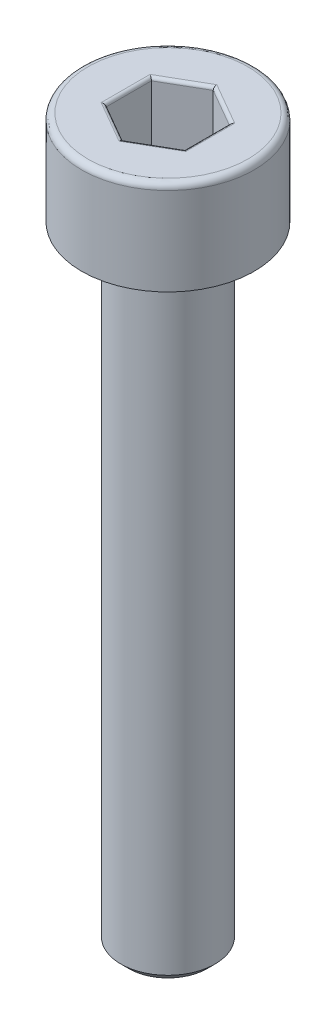
ISO-10303-21;
HEADER;
FILE_DESCRIPTION(('STEP AP214'),'2;1');
FILE_NAME('part.step','',(''),(''),'','','');
FILE_SCHEMA(('AUTOMOTIVE_DESIGN { 1 0 10303 214 1 1 1 1 }'));
ENDSEC;
DATA;
#1=APPLICATION_CONTEXT('core data for automotive mechanical design processes');
#2=APPLICATION_PROTOCOL_DEFINITION('international standard','automotive_design',2000,#1);
#3=PRODUCT_CONTEXT('',#1,'mechanical');
#4=PRODUCT('Part','Part','',(#3));
#5=PRODUCT_RELATED_PRODUCT_CATEGORY('part','',(#4));
#6=PRODUCT_DEFINITION_FORMATION('','',#4);
#7=PRODUCT_DEFINITION_CONTEXT('part definition',#1,'design');
#8=PRODUCT_DEFINITION('design','',#6,#7);
#9=PRODUCT_DEFINITION_SHAPE('','',#8);
#10=(LENGTH_UNIT() NAMED_UNIT(*) SI_UNIT(.MILLI.,.METRE.));
#11=(NAMED_UNIT(*) PLANE_ANGLE_UNIT() SI_UNIT($,.RADIAN.));
#12=(NAMED_UNIT(*) SI_UNIT($,.STERADIAN.) SOLID_ANGLE_UNIT());
#13=UNCERTAINTY_MEASURE_WITH_UNIT(LENGTH_MEASURE(1.E-05),#10,'distance_accuracy_value','');
#14=(GEOMETRIC_REPRESENTATION_CONTEXT(3) GLOBAL_UNCERTAINTY_ASSIGNED_CONTEXT((#13)) GLOBAL_UNIT_ASSIGNED_CONTEXT((#10,
#11,#12)) REPRESENTATION_CONTEXT('',''));
#15=CARTESIAN_POINT('',(0.,0.,0.));
#16=DIRECTION('',(0.,0.,1.));
#17=DIRECTION('',(1.,0.,0.));
#18=AXIS2_PLACEMENT_3D('',#15,#16,#17);
#19=CARTESIAN_POINT('',(0.,-23.,0.));
#20=DIRECTION('',(0.,-1.,0.));
#21=DIRECTION('',(0.,0.,-1.));
#22=AXIS2_PLACEMENT_3D('',#19,#20,#21);
#23=PLANE('',#22);
#24=CARTESIAN_POINT('',(0.,-23.,0.));
#25=DIRECTION('',(0.,-1.,0.));
#26=DIRECTION('',(0.,0.,-1.));
#27=AXIS2_PLACEMENT_3D('',#24,#25,#26);
#28=CIRCLE('',#27,1.25);
#29=CARTESIAN_POINT('',(0.,-23.,-1.25));
#30=VERTEX_POINT('',#29);
#31=EDGE_CURVE('E263',#30,#30,#28,.T.);
#32=ORIENTED_EDGE('',*,*,#31,.T.);
#33=EDGE_LOOP('',(#32));
#34=FACE_BOUND('',#33,.T.);
#35=ADVANCED_FACE('F35',(#34),#23,.T.);
#36=CARTESIAN_POINT('',(0.,0.,0.));
#37=DIRECTION('',(0.,1.,0.));
#38=DIRECTION('',(0.,0.,1.));
#39=AXIS2_PLACEMENT_3D('',#36,#37,#38);
#40=CYLINDRICAL_SURFACE('',#39,1.5);
#41=CARTESIAN_POINT('',(0.,-3.25,0.));
#42=DIRECTION('',(0.,-1.,0.));
#43=DIRECTION('',(0.,0.,-1.));
#44=AXIS2_PLACEMENT_3D('',#41,#42,#43);
#45=CIRCLE('',#44,1.5);
#46=CARTESIAN_POINT('',(0.,-3.25,-1.5));
#47=VERTEX_POINT('',#46);
#48=EDGE_CURVE('E260',#47,#47,#45,.T.);
#49=ORIENTED_EDGE('',*,*,#48,.T.);
#50=EDGE_LOOP('',(#49));
#51=FACE_BOUND('',#50,.T.);
#52=CARTESIAN_POINT('',(0.,-22.75,0.));
#53=DIRECTION('',(0.,-1.,0.));
#54=DIRECTION('',(0.,0.,-1.));
#55=AXIS2_PLACEMENT_3D('',#52,#53,#54);
#56=CIRCLE('',#55,1.5);
#57=CARTESIAN_POINT('',(0.,-22.75,-1.5));
#58=VERTEX_POINT('',#57);
#59=EDGE_CURVE('E257',#58,#58,#56,.F.);
#60=ORIENTED_EDGE('',*,*,#59,.T.);
#61=EDGE_LOOP('',(#60));
#62=FACE_BOUND('',#61,.T.);
#63=ADVANCED_FACE('F289',(#51,#62),#40,.T.);
#64=CARTESIAN_POINT('',(-1.5,-3.,0.));
#65=DIRECTION('',(0.,-1.,0.));
#66=DIRECTION('',(0.,0.,-1.));
#67=AXIS2_PLACEMENT_3D('',#64,#65,#66);
#68=PLANE('',#67);
#69=CARTESIAN_POINT('',(0.,-3.,0.));
#70=DIRECTION('',(0.,-1.,0.));
#71=DIRECTION('',(0.,0.,-1.));
#72=AXIS2_PLACEMENT_3D('',#69,#70,#71);
#73=CIRCLE('',#72,1.75);
#74=CARTESIAN_POINT('',(0.,-3.,-1.75));
#75=VERTEX_POINT('',#74);
#76=EDGE_CURVE('E254',#75,#75,#73,.F.);
#77=ORIENTED_EDGE('',*,*,#76,.T.);
#78=EDGE_LOOP('',(#77));
#79=FACE_BOUND('',#78,.T.);
#80=CARTESIAN_POINT('',(0.,-3.,0.));
#81=DIRECTION('',(0.,1.,0.));
#82=DIRECTION('',(0.,0.,1.));
#83=AXIS2_PLACEMENT_3D('',#80,#81,#82);
#84=CIRCLE('',#83,2.75);
#85=CARTESIAN_POINT('',(0.,-3.,2.75));
#86=VERTEX_POINT('',#85);
#87=EDGE_CURVE('E251',#86,#86,#84,.T.);
#88=ORIENTED_EDGE('',*,*,#87,.F.);
#89=EDGE_LOOP('',(#88));
#90=FACE_BOUND('',#89,.T.);
#91=ADVANCED_FACE('F295',(#79,#90),#68,.T.);
#92=CARTESIAN_POINT('',(0.,0.,0.));
#93=DIRECTION('',(0.,1.,0.));
#94=DIRECTION('',(0.,0.,1.));
#95=AXIS2_PLACEMENT_3D('',#92,#93,#94);
#96=CYLINDRICAL_SURFACE('',#95,2.75);
#97=CARTESIAN_POINT('',(0.,-0.2,0.));
#98=DIRECTION('',(0.,1.,0.));
#99=DIRECTION('',(0.,0.,1.));
#100=AXIS2_PLACEMENT_3D('',#97,#98,#99);
#101=CIRCLE('',#100,2.75);
#102=CARTESIAN_POINT('',(0.,-0.2,2.75));
#103=VERTEX_POINT('',#102);
#104=EDGE_CURVE('E161',#103,#103,#101,.F.);
#105=ORIENTED_EDGE('',*,*,#104,.T.);
#106=EDGE_LOOP('',(#105));
#107=FACE_BOUND('',#106,.T.);
#108=ORIENTED_EDGE('',*,*,#87,.T.);
#109=EDGE_LOOP('',(#108));
#110=FACE_BOUND('',#109,.T.);
#111=ADVANCED_FACE('F305',(#107,#110),#96,.T.);
#112=CARTESIAN_POINT('',(-2.75,0.,0.));
#113=DIRECTION('',(0.,1.,0.));
#114=DIRECTION('',(0.,0.,1.));
#115=AXIS2_PLACEMENT_3D('',#112,#113,#114);
#116=PLANE('',#115);
#117=DIRECTION('',(0.,0.,1.));
#118=VECTOR('',#117,1.);
#119=CARTESIAN_POINT('',(-1.35,0.,-0.721687836487033));
#120=LINE('',#119,#118);
#121=CARTESIAN_POINT('',(-1.35,0.,0.779422863405995));
#122=VERTEX_POINT('',#121);
#123=CARTESIAN_POINT('',(-1.35,0.,-0.779422863405995));
#124=VERTEX_POINT('',#123);
#125=EDGE_CURVE('E177',#122,#124,#120,.F.);
#126=ORIENTED_EDGE('',*,*,#125,.T.);
#127=DIRECTION('',(-0.866025403784439,0.,0.5));
#128=VECTOR('',#127,1.);
#129=CARTESIAN_POINT('',(-0.0500000000000002,0.,-1.52997821335251));
#130=LINE('',#129,#128);
#131=CARTESIAN_POINT('',(0.,0.,-1.55884572681199));
#132=VERTEX_POINT('',#131);
#133=EDGE_CURVE('E136',#124,#132,#130,.F.);
#134=ORIENTED_EDGE('',*,*,#133,.T.);
#135=DIRECTION('',(-0.866025403784439,0.,-0.5));
#136=VECTOR('',#135,1.);
#137=CARTESIAN_POINT('',(1.3,0.,-0.808290376865477));
#138=LINE('',#137,#136);
#139=CARTESIAN_POINT('',(1.35,0.,-0.779422863405995));
#140=VERTEX_POINT('',#139);
#141=EDGE_CURVE('E163',#132,#140,#138,.F.);
#142=ORIENTED_EDGE('',*,*,#141,.T.);
#143=DIRECTION('',(0.,0.,-1.));
#144=VECTOR('',#143,1.);
#145=CARTESIAN_POINT('',(1.35,0.,0.721687836487034));
#146=LINE('',#145,#144);
#147=CARTESIAN_POINT('',(1.35,0.,0.779422863405996));
#148=VERTEX_POINT('',#147);
#149=EDGE_CURVE('E171',#140,#148,#146,.F.);
#150=ORIENTED_EDGE('',*,*,#149,.T.);
#151=DIRECTION('',(0.866025403784439,0.,-0.5));
#152=VECTOR('',#151,1.);
#153=CARTESIAN_POINT('',(0.05,0.,1.52997821335251));
#154=LINE('',#153,#152);
#155=CARTESIAN_POINT('',(0.,0.,1.55884572681199));
#156=VERTEX_POINT('',#155);
#157=EDGE_CURVE('E173',#148,#156,#154,.F.);
#158=ORIENTED_EDGE('',*,*,#157,.T.);
#159=DIRECTION('',(0.866025403784438,0.,0.5));
#160=VECTOR('',#159,1.);
#161=CARTESIAN_POINT('',(-1.3,0.,0.808290376865476));
#162=LINE('',#161,#160);
#163=EDGE_CURVE('E175',#156,#122,#162,.F.);
#164=ORIENTED_EDGE('',*,*,#163,.T.);
#165=EDGE_LOOP('',(#126,#134,#142,#150,#158,#164));
#166=FACE_BOUND('',#165,.T.);
#167=CARTESIAN_POINT('',(0.,0.,0.));
#168=DIRECTION('',(0.,1.,0.));
#169=DIRECTION('',(0.,0.,1.));
#170=AXIS2_PLACEMENT_3D('',#167,#168,#169);
#171=CIRCLE('',#170,2.55);
#172=CARTESIAN_POINT('',(0.,0.,2.55));
#173=VERTEX_POINT('',#172);
#174=EDGE_CURVE('E166',#173,#173,#171,.T.);
#175=ORIENTED_EDGE('',*,*,#174,.T.);
#176=EDGE_LOOP('',(#175));
#177=FACE_BOUND('',#176,.T.);
#178=ADVANCED_FACE('F268',(#166,#177),#116,.T.);
#179=CARTESIAN_POINT('',(0.,-3.,0.));
#180=DIRECTION('',(0.,1.,0.));
#181=DIRECTION('',(0.,0.,1.));
#182=AXIS2_PLACEMENT_3D('',#179,#180,#181);
#183=CONICAL_SURFACE('',#182,1.75,0.785398163397452);
#184=ORIENTED_EDGE('',*,*,#48,.F.);
#185=EDGE_LOOP('',(#184));
#186=FACE_BOUND('',#185,.T.);
#187=ORIENTED_EDGE('',*,*,#76,.F.);
#188=EDGE_LOOP('',(#187));
#189=FACE_BOUND('',#188,.T.);
#190=ADVANCED_FACE('F283',(#186,#189),#183,.T.);
#191=CARTESIAN_POINT('',(0.,-22.75,0.));
#192=DIRECTION('',(0.,1.,0.));
#193=DIRECTION('',(0.,0.,1.));
#194=AXIS2_PLACEMENT_3D('',#191,#192,#193);
#195=CONICAL_SURFACE('',#194,1.5,0.785398163397444);
#196=ORIENTED_EDGE('',*,*,#31,.F.);
#197=EDGE_LOOP('',(#196));
#198=FACE_BOUND('',#197,.T.);
#199=ORIENTED_EDGE('',*,*,#59,.F.);
#200=EDGE_LOOP('',(#199));
#201=FACE_BOUND('',#200,.T.);
#202=ADVANCED_FACE('F273',(#198,#201),#195,.T.);
#203=CARTESIAN_POINT('',(0.,-0.2,0.));
#204=DIRECTION('',(0.,1.,0.));
#205=DIRECTION('',(0.,0.,1.));
#206=AXIS2_PLACEMENT_3D('',#203,#204,#205);
#207=TOROIDAL_SURFACE('',#206,2.55,0.2);
#208=ORIENTED_EDGE('',*,*,#104,.F.);
#209=EDGE_LOOP('',(#208));
#210=FACE_BOUND('',#209,.T.);
#211=ORIENTED_EDGE('',*,*,#174,.F.);
#212=EDGE_LOOP('',(#211));
#213=FACE_BOUND('',#212,.T.);
#214=ADVANCED_FACE('F270',(#210,#213),#207,.T.);
#215=CARTESIAN_POINT('',(1.25,-2.,-0.721687836487033));
#216=DIRECTION('',(0.5,0.,-0.866025403784439));
#217=DIRECTION('',(-0.866025403784439,0.,-0.5));
#218=AXIS2_PLACEMENT_3D('',#215,#216,#217);
#219=PLANE('',#218);
#220=DIRECTION('',(0.,1.,0.));
#221=VECTOR('',#220,1.);
#222=CARTESIAN_POINT('',(1.25,-2.,-0.721687836487033));
#223=LINE('',#222,#221);
#224=CARTESIAN_POINT('',(1.25,-1.9,-0.721687836487033));
#225=VERTEX_POINT('',#224);
#226=CARTESIAN_POINT('',(1.25,-0.1,-0.721687836487033));
#227=VERTEX_POINT('',#226);
#228=EDGE_CURVE('E245',#225,#227,#223,.T.);
#229=ORIENTED_EDGE('',*,*,#228,.T.);
#230=DIRECTION('',(-0.866025403784439,0.,-0.5));
#231=VECTOR('',#230,1.);
#232=CARTESIAN_POINT('',(0.,-0.1,-1.44337567297406));
#233=LINE('',#232,#231);
#234=CARTESIAN_POINT('',(0.,-0.1,-1.44337567297406));
#235=VERTEX_POINT('',#234);
#236=EDGE_CURVE('E197',#227,#235,#233,.T.);
#237=ORIENTED_EDGE('',*,*,#236,.T.);
#238=DIRECTION('',(0.,1.,0.));
#239=VECTOR('',#238,1.);
#240=CARTESIAN_POINT('',(0.,-2.,-1.44337567297406));
#241=LINE('',#240,#239);
#242=CARTESIAN_POINT('',(0.,-1.9,-1.44337567297406));
#243=VERTEX_POINT('',#242);
#244=EDGE_CURVE('E147',#243,#235,#241,.T.);
#245=ORIENTED_EDGE('',*,*,#244,.F.);
#246=DIRECTION('',(-0.866025403784439,0.,-0.5));
#247=VECTOR('',#246,1.);
#248=CARTESIAN_POINT('',(1.25,-1.9,-0.721687836487033));
#249=LINE('',#248,#247);
#250=EDGE_CURVE('E195',#243,#225,#249,.F.);
#251=ORIENTED_EDGE('',*,*,#250,.T.);
#252=EDGE_LOOP('',(#229,#237,#245,#251));
#253=FACE_BOUND('',#252,.T.);
#254=ADVANCED_FACE('F272',(#253),#219,.F.);
#255=CARTESIAN_POINT('',(1.25,-2.,0.721687836487034));
#256=DIRECTION('',(1.,0.,0.));
#257=DIRECTION('',(0.,0.,-1.));
#258=AXIS2_PLACEMENT_3D('',#255,#256,#257);
#259=PLANE('',#258);
#260=DIRECTION('',(0.,1.,0.));
#261=VECTOR('',#260,1.);
#262=CARTESIAN_POINT('',(1.25,-2.,0.721687836487034));
#263=LINE('',#262,#261);
#264=CARTESIAN_POINT('',(1.25,-1.9,0.721687836487034));
#265=VERTEX_POINT('',#264);
#266=CARTESIAN_POINT('',(1.25,-0.1,0.721687836487034));
#267=VERTEX_POINT('',#266);
#268=EDGE_CURVE('E242',#265,#267,#263,.T.);
#269=ORIENTED_EDGE('',*,*,#268,.T.);
#270=DIRECTION('',(0.,0.,-1.));
#271=VECTOR('',#270,1.);
#272=CARTESIAN_POINT('',(1.25,-0.1,-0.721687836487033));
#273=LINE('',#272,#271);
#274=EDGE_CURVE('E193',#267,#227,#273,.T.);
#275=ORIENTED_EDGE('',*,*,#274,.T.);
#276=ORIENTED_EDGE('',*,*,#228,.F.);
#277=DIRECTION('',(0.,0.,-1.));
#278=VECTOR('',#277,1.);
#279=CARTESIAN_POINT('',(1.25,-1.9,0.721687836487034));
#280=LINE('',#279,#278);
#281=EDGE_CURVE('E190',#225,#265,#280,.F.);
#282=ORIENTED_EDGE('',*,*,#281,.T.);
#283=EDGE_LOOP('',(#269,#275,#276,#282));
#284=FACE_BOUND('',#283,.T.);
#285=ADVANCED_FACE('F280',(#284),#259,.F.);
#286=CARTESIAN_POINT('',(0.,-2.,1.44337567297407));
#287=DIRECTION('',(0.5,0.,0.866025403784439));
#288=DIRECTION('',(0.866025403784439,0.,-0.5));
#289=AXIS2_PLACEMENT_3D('',#286,#287,#288);
#290=PLANE('',#289);
#291=DIRECTION('',(0.,1.,0.));
#292=VECTOR('',#291,1.);
#293=CARTESIAN_POINT('',(0.,-2.,1.44337567297407));
#294=LINE('',#293,#292);
#295=CARTESIAN_POINT('',(0.,-1.9,1.44337567297407));
#296=VERTEX_POINT('',#295);
#297=CARTESIAN_POINT('',(0.,-0.1,1.44337567297407));
#298=VERTEX_POINT('',#297);
#299=EDGE_CURVE('E239',#296,#298,#294,.T.);
#300=ORIENTED_EDGE('',*,*,#299,.T.);
#301=DIRECTION('',(0.866025403784439,0.,-0.5));
#302=VECTOR('',#301,1.);
#303=CARTESIAN_POINT('',(1.25,-0.1,0.721687836487034));
#304=LINE('',#303,#302);
#305=EDGE_CURVE('E188',#298,#267,#304,.T.);
#306=ORIENTED_EDGE('',*,*,#305,.T.);
#307=ORIENTED_EDGE('',*,*,#268,.F.);
#308=DIRECTION('',(0.866025403784439,0.,-0.5));
#309=VECTOR('',#308,1.);
#310=CARTESIAN_POINT('',(0.,-1.9,1.44337567297407));
#311=LINE('',#310,#309);
#312=EDGE_CURVE('E186',#265,#296,#311,.F.);
#313=ORIENTED_EDGE('',*,*,#312,.T.);
#314=EDGE_LOOP('',(#300,#306,#307,#313));
#315=FACE_BOUND('',#314,.T.);
#316=ADVANCED_FACE('F329',(#315),#290,.F.);
#317=CARTESIAN_POINT('',(-1.25,-2.,0.721687836487033));
#318=DIRECTION('',(-0.5,0.,0.866025403784439));
#319=DIRECTION('',(0.866025403784438,0.,0.5));
#320=AXIS2_PLACEMENT_3D('',#317,#318,#319);
#321=PLANE('',#320);
#322=DIRECTION('',(0.,1.,0.));
#323=VECTOR('',#322,1.);
#324=CARTESIAN_POINT('',(-1.25,-2.,0.721687836487033));
#325=LINE('',#324,#323);
#326=CARTESIAN_POINT('',(-1.25,-1.9,0.721687836487033));
#327=VERTEX_POINT('',#326);
#328=CARTESIAN_POINT('',(-1.25,-0.1,0.721687836487033));
#329=VERTEX_POINT('',#328);
#330=EDGE_CURVE('E130',#327,#329,#325,.T.);
#331=ORIENTED_EDGE('',*,*,#330,.T.);
#332=DIRECTION('',(0.866025403784438,0.,0.5));
#333=VECTOR('',#332,1.);
#334=CARTESIAN_POINT('',(0.,-0.1,1.44337567297407));
#335=LINE('',#334,#333);
#336=EDGE_CURVE('E184',#329,#298,#335,.T.);
#337=ORIENTED_EDGE('',*,*,#336,.T.);
#338=ORIENTED_EDGE('',*,*,#299,.F.);
#339=DIRECTION('',(0.866025403784438,0.,0.5));
#340=VECTOR('',#339,1.);
#341=CARTESIAN_POINT('',(-1.25,-1.9,0.721687836487033));
#342=LINE('',#341,#340);
#343=EDGE_CURVE('E182',#296,#327,#342,.F.);
#344=ORIENTED_EDGE('',*,*,#343,.T.);
#345=EDGE_LOOP('',(#331,#337,#338,#344));
#346=FACE_BOUND('',#345,.T.);
#347=ADVANCED_FACE('F236',(#346),#321,.F.);
#348=CARTESIAN_POINT('',(-1.25,-2.,-0.721687836487033));
#349=DIRECTION('',(-1.,0.,0.));
#350=DIRECTION('',(0.,0.,1.));
#351=AXIS2_PLACEMENT_3D('',#348,#349,#350);
#352=PLANE('',#351);
#353=DIRECTION('',(0.,1.,0.));
#354=VECTOR('',#353,1.);
#355=CARTESIAN_POINT('',(-1.25,-2.,-0.721687836487033));
#356=LINE('',#355,#354);
#357=CARTESIAN_POINT('',(-1.25,-1.9,-0.721687836487033));
#358=VERTEX_POINT('',#357);
#359=CARTESIAN_POINT('',(-1.25,-0.1,-0.721687836487033));
#360=VERTEX_POINT('',#359);
#361=EDGE_CURVE('E128',#358,#360,#356,.T.);
#362=ORIENTED_EDGE('',*,*,#361,.T.);
#363=DIRECTION('',(0.,0.,1.));
#364=VECTOR('',#363,1.);
#365=CARTESIAN_POINT('',(-1.25,-0.1,0.721687836487033));
#366=LINE('',#365,#364);
#367=EDGE_CURVE('E135',#360,#329,#366,.T.);
#368=ORIENTED_EDGE('',*,*,#367,.T.);
#369=ORIENTED_EDGE('',*,*,#330,.F.);
#370=DIRECTION('',(0.,0.,1.));
#371=VECTOR('',#370,1.);
#372=CARTESIAN_POINT('',(-1.25,-1.9,-0.721687836487033));
#373=LINE('',#372,#371);
#374=EDGE_CURVE('E125',#327,#358,#373,.F.);
#375=ORIENTED_EDGE('',*,*,#374,.T.);
#376=EDGE_LOOP('',(#362,#368,#369,#375));
#377=FACE_BOUND('',#376,.T.);
#378=ADVANCED_FACE('F127',(#377),#352,.F.);
#379=CARTESIAN_POINT('',(0.,-2.,-1.44337567297406));
#380=DIRECTION('',(-0.5,0.,-0.866025403784439));
#381=DIRECTION('',(-0.866025403784439,0.,0.5));
#382=AXIS2_PLACEMENT_3D('',#379,#380,#381);
#383=PLANE('',#382);
#384=ORIENTED_EDGE('',*,*,#244,.T.);
#385=DIRECTION('',(-0.866025403784439,0.,0.5));
#386=VECTOR('',#385,1.);
#387=CARTESIAN_POINT('',(-1.25,-0.1,-0.721687836487032));
#388=LINE('',#387,#386);
#389=EDGE_CURVE('E146',#235,#360,#388,.T.);
#390=ORIENTED_EDGE('',*,*,#389,.T.);
#391=ORIENTED_EDGE('',*,*,#361,.F.);
#392=DIRECTION('',(-0.866025403784439,0.,0.5));
#393=VECTOR('',#392,1.);
#394=CARTESIAN_POINT('',(0.,-1.9,-1.44337567297406));
#395=LINE('',#394,#393);
#396=EDGE_CURVE('E143',#358,#243,#395,.F.);
#397=ORIENTED_EDGE('',*,*,#396,.T.);
#398=EDGE_LOOP('',(#384,#390,#391,#397));
#399=FACE_BOUND('',#398,.T.);
#400=ADVANCED_FACE('F141',(#399),#383,.F.);
#401=CARTESIAN_POINT('',(1.25,-2.,-0.721687836487033));
#402=DIRECTION('',(0.,-1.,0.));
#403=DIRECTION('',(0.,0.,-1.));
#404=AXIS2_PLACEMENT_3D('',#401,#402,#403);
#405=PLANE('',#404);
#406=DIRECTION('',(0.866025403784439,0.,-0.5));
#407=VECTOR('',#406,1.);
#408=CARTESIAN_POINT('',(1.2,-2.,0.63508529610859));
#409=LINE('',#408,#407);
#410=CARTESIAN_POINT('',(0.,-2.,1.32790561913614));
#411=VERTEX_POINT('',#410);
#412=CARTESIAN_POINT('',(1.15,-2.,0.663952809568071));
#413=VERTEX_POINT('',#412);
#414=EDGE_CURVE('E44',#411,#413,#409,.T.);
#415=ORIENTED_EDGE('',*,*,#414,.T.);
#416=DIRECTION('',(0.,0.,-1.));
#417=VECTOR('',#416,1.);
#418=CARTESIAN_POINT('',(1.15,-2.,-0.721687836487033));
#419=LINE('',#418,#417);
#420=CARTESIAN_POINT('',(1.15,-2.,-0.66395280956807));
#421=VERTEX_POINT('',#420);
#422=EDGE_CURVE('E11',#413,#421,#419,.T.);
#423=ORIENTED_EDGE('',*,*,#422,.T.);
#424=DIRECTION('',(-0.866025403784439,0.,-0.5));
#425=VECTOR('',#424,1.);
#426=CARTESIAN_POINT('',(-0.0500000000000001,-2.,-1.35677313259562));
#427=LINE('',#426,#425);
#428=CARTESIAN_POINT('',(0.,-2.,-1.32790561913614));
#429=VERTEX_POINT('',#428);
#430=EDGE_CURVE('E199',#421,#429,#427,.T.);
#431=ORIENTED_EDGE('',*,*,#430,.T.);
#432=DIRECTION('',(-0.866025403784439,0.,0.5));
#433=VECTOR('',#432,1.);
#434=CARTESIAN_POINT('',(-1.2,-2.,-0.635085296108588));
#435=LINE('',#434,#433);
#436=CARTESIAN_POINT('',(-1.15,-2.,-0.66395280956807));
#437=VERTEX_POINT('',#436);
#438=EDGE_CURVE('E201',#429,#437,#435,.T.);
#439=ORIENTED_EDGE('',*,*,#438,.T.);
#440=DIRECTION('',(0.,0.,1.));
#441=VECTOR('',#440,1.);
#442=CARTESIAN_POINT('',(-1.15,-2.,0.721687836487033));
#443=LINE('',#442,#441);
#444=CARTESIAN_POINT('',(-1.15,-2.,0.66395280956807));
#445=VERTEX_POINT('',#444);
#446=EDGE_CURVE('E152',#437,#445,#443,.T.);
#447=ORIENTED_EDGE('',*,*,#446,.T.);
#448=DIRECTION('',(0.866025403784438,0.,0.5));
#449=VECTOR('',#448,1.);
#450=CARTESIAN_POINT('',(0.0499999999999999,-2.,1.35677313259562));
#451=LINE('',#450,#449);
#452=EDGE_CURVE('E55',#445,#411,#451,.T.);
#453=ORIENTED_EDGE('',*,*,#452,.T.);
#454=EDGE_LOOP('',(#415,#423,#431,#439,#447,#453));
#455=FACE_BOUND('',#454,.T.);
#456=ADVANCED_FACE('F324',(#455),#405,.F.);
#457=CARTESIAN_POINT('',(0.05,-0.1,1.52997821335251));
#458=DIRECTION('',(-0.866025403784439,0.,0.5));
#459=DIRECTION('',(0.5,0.,0.866025403784439));
#460=AXIS2_PLACEMENT_3D('',#457,#458,#459);
#461=CYLINDRICAL_SURFACE('',#460,0.1);
#462=CARTESIAN_POINT('',(0.,-0.1,1.55884572681199));
#463=DIRECTION('',(-1.,0.,0.));
#464=DIRECTION('',(0.,0.,-1.));
#465=AXIS2_PLACEMENT_3D('',#462,#463,#464);
#466=ELLIPSE('',#465,0.115470053837925,0.1);
#467=EDGE_CURVE('E216',#156,#298,#466,.T.);
#468=ORIENTED_EDGE('',*,*,#467,.F.);
#469=ORIENTED_EDGE('',*,*,#157,.F.);
#470=CARTESIAN_POINT('',(1.35,-0.1,0.779422863405997));
#471=DIRECTION('',(-0.5,0.,0.866025403784438));
#472=DIRECTION('',(-0.866025403784438,0.,-0.5));
#473=AXIS2_PLACEMENT_3D('',#470,#471,#472);
#474=ELLIPSE('',#473,0.115470053837925,0.1);
#475=EDGE_CURVE('E219',#267,#148,#474,.F.);
#476=ORIENTED_EDGE('',*,*,#475,.F.);
#477=ORIENTED_EDGE('',*,*,#305,.F.);
#478=EDGE_LOOP('',(#468,#469,#476,#477));
#479=FACE_BOUND('',#478,.T.);
#480=ADVANCED_FACE('F336',(#479),#461,.T.);
#481=CARTESIAN_POINT('',(1.35,-0.1,0.721687836487034));
#482=DIRECTION('',(0.,0.,1.));
#483=DIRECTION('',(1.,0.,0.));
#484=AXIS2_PLACEMENT_3D('',#481,#482,#483);
#485=CYLINDRICAL_SURFACE('',#484,0.1);
#486=ORIENTED_EDGE('',*,*,#475,.T.);
#487=ORIENTED_EDGE('',*,*,#149,.F.);
#488=CARTESIAN_POINT('',(1.35,-0.1,-0.779422863405995));
#489=DIRECTION('',(0.5,0.,0.866025403784439));
#490=DIRECTION('',(-0.866025403784439,0.,0.5));
#491=AXIS2_PLACEMENT_3D('',#488,#489,#490);
#492=ELLIPSE('',#491,0.115470053837925,0.1);
#493=EDGE_CURVE('E213',#227,#140,#492,.F.);
#494=ORIENTED_EDGE('',*,*,#493,.F.);
#495=ORIENTED_EDGE('',*,*,#274,.F.);
#496=EDGE_LOOP('',(#486,#487,#494,#495));
#497=FACE_BOUND('',#496,.T.);
#498=ADVANCED_FACE('F340',(#497),#485,.T.);
#499=CARTESIAN_POINT('',(-1.3,-0.1,0.808290376865476));
#500=DIRECTION('',(-0.866025403784438,0.,-0.5));
#501=DIRECTION('',(-0.5,0.,0.866025403784439));
#502=AXIS2_PLACEMENT_3D('',#499,#500,#501);
#503=CYLINDRICAL_SURFACE('',#502,0.1);
#504=ORIENTED_EDGE('',*,*,#467,.T.);
#505=ORIENTED_EDGE('',*,*,#336,.F.);
#506=CARTESIAN_POINT('',(-1.35,-0.1,0.779422863405995));
#507=DIRECTION('',(-0.5,0.,-0.866025403784439));
#508=DIRECTION('',(0.866025403784439,0.,-0.5));
#509=AXIS2_PLACEMENT_3D('',#506,#507,#508);
#510=ELLIPSE('',#509,0.115470053837925,0.1);
#511=EDGE_CURVE('E210',#122,#329,#510,.T.);
#512=ORIENTED_EDGE('',*,*,#511,.F.);
#513=ORIENTED_EDGE('',*,*,#163,.F.);
#514=EDGE_LOOP('',(#504,#505,#512,#513));
#515=FACE_BOUND('',#514,.T.);
#516=ADVANCED_FACE('F346',(#515),#503,.T.);
#517=CARTESIAN_POINT('',(1.3,-0.1,-0.808290376865477));
#518=DIRECTION('',(0.866025403784439,0.,0.5));
#519=DIRECTION('',(0.5,0.,-0.866025403784439));
#520=AXIS2_PLACEMENT_3D('',#517,#518,#519);
#521=CYLINDRICAL_SURFACE('',#520,0.1);
#522=ORIENTED_EDGE('',*,*,#493,.T.);
#523=ORIENTED_EDGE('',*,*,#141,.F.);
#524=CARTESIAN_POINT('',(0.,-0.1,-1.55884572681199));
#525=DIRECTION('',(1.,0.,0.));
#526=DIRECTION('',(0.,0.,-1.));
#527=AXIS2_PLACEMENT_3D('',#524,#525,#526);
#528=ELLIPSE('',#527,0.115470053837925,0.1);
#529=EDGE_CURVE('E208',#235,#132,#528,.F.);
#530=ORIENTED_EDGE('',*,*,#529,.F.);
#531=ORIENTED_EDGE('',*,*,#236,.F.);
#532=EDGE_LOOP('',(#522,#523,#530,#531));
#533=FACE_BOUND('',#532,.T.);
#534=ADVANCED_FACE('F376',(#533),#521,.T.);
#535=CARTESIAN_POINT('',(-1.35,-0.1,-0.721687836487033));
#536=DIRECTION('',(0.,0.,-1.));
#537=DIRECTION('',(-1.,0.,0.));
#538=AXIS2_PLACEMENT_3D('',#535,#536,#537);
#539=CYLINDRICAL_SURFACE('',#538,0.1);
#540=ORIENTED_EDGE('',*,*,#511,.T.);
#541=ORIENTED_EDGE('',*,*,#367,.F.);
#542=CARTESIAN_POINT('',(-1.35,-0.1,-0.779422863405995));
#543=DIRECTION('',(0.5,0.,-0.866025403784439));
#544=DIRECTION('',(0.866025403784439,0.,0.5));
#545=AXIS2_PLACEMENT_3D('',#542,#543,#544);
#546=ELLIPSE('',#545,0.115470053837925,0.1);
#547=EDGE_CURVE('E206',#124,#360,#546,.T.);
#548=ORIENTED_EDGE('',*,*,#547,.F.);
#549=ORIENTED_EDGE('',*,*,#125,.F.);
#550=EDGE_LOOP('',(#540,#541,#548,#549));
#551=FACE_BOUND('',#550,.T.);
#552=ADVANCED_FACE('F371',(#551),#539,.T.);
#553=CARTESIAN_POINT('',(-0.05,-0.1,-1.52997821335251));
#554=DIRECTION('',(0.866025403784439,0.,-0.5));
#555=DIRECTION('',(-0.5,0.,-0.866025403784439));
#556=AXIS2_PLACEMENT_3D('',#553,#554,#555);
#557=CYLINDRICAL_SURFACE('',#556,0.1);
#558=ORIENTED_EDGE('',*,*,#529,.T.);
#559=ORIENTED_EDGE('',*,*,#133,.F.);
#560=ORIENTED_EDGE('',*,*,#547,.T.);
#561=ORIENTED_EDGE('',*,*,#389,.F.);
#562=EDGE_LOOP('',(#558,#559,#560,#561));
#563=FACE_BOUND('',#562,.T.);
#564=ADVANCED_FACE('F367',(#563),#557,.T.);
#565=CARTESIAN_POINT('',(-1.15,-1.9,-0.721687836487033));
#566=DIRECTION('',(0.,0.,-1.));
#567=DIRECTION('',(-1.,0.,0.));
#568=AXIS2_PLACEMENT_3D('',#565,#566,#567);
#569=CYLINDRICAL_SURFACE('',#568,0.1);
#570=CARTESIAN_POINT('',(-1.15,-1.9,-0.663952809568069));
#571=DIRECTION('',(0.5,0.,-0.866025403784439));
#572=DIRECTION('',(-0.866025403784439,0.,-0.5));
#573=AXIS2_PLACEMENT_3D('',#570,#571,#572);
#574=ELLIPSE('',#573,0.115470053837925,0.1);
#575=EDGE_CURVE('E151',#358,#437,#574,.F.);
#576=ORIENTED_EDGE('',*,*,#575,.F.);
#577=ORIENTED_EDGE('',*,*,#374,.F.);
#578=CARTESIAN_POINT('',(-1.15,-1.9,0.66395280956807));
#579=DIRECTION('',(-0.5,0.,-0.866025403784439));
#580=DIRECTION('',(-0.866025403784439,0.,0.5));
#581=AXIS2_PLACEMENT_3D('',#578,#579,#580);
#582=ELLIPSE('',#581,0.115470053837925,0.1);
#583=EDGE_CURVE('E39',#445,#327,#582,.T.);
#584=ORIENTED_EDGE('',*,*,#583,.F.);
#585=ORIENTED_EDGE('',*,*,#446,.F.);
#586=EDGE_LOOP('',(#576,#577,#584,#585));
#587=FACE_BOUND('',#586,.T.);
#588=ADVANCED_FACE('F37',(#587),#569,.F.);
#589=CARTESIAN_POINT('',(0.0499999999999988,-1.9,1.35677313259562));
#590=DIRECTION('',(-0.866025403784438,0.,-0.5));
#591=DIRECTION('',(-0.5,0.,0.866025403784439));
#592=AXIS2_PLACEMENT_3D('',#589,#590,#591);
#593=CYLINDRICAL_SURFACE('',#592,0.1);
#594=ORIENTED_EDGE('',*,*,#583,.T.);
#595=ORIENTED_EDGE('',*,*,#343,.F.);
#596=CARTESIAN_POINT('',(0.,-1.9,1.32790561913614));
#597=DIRECTION('',(-1.,0.,0.));
#598=DIRECTION('',(0.,0.,1.));
#599=AXIS2_PLACEMENT_3D('',#596,#597,#598);
#600=ELLIPSE('',#599,0.115470053837925,0.1);
#601=EDGE_CURVE('E155',#411,#296,#600,.T.);
#602=ORIENTED_EDGE('',*,*,#601,.F.);
#603=ORIENTED_EDGE('',*,*,#452,.F.);
#604=EDGE_LOOP('',(#594,#595,#602,#603));
#605=FACE_BOUND('',#604,.T.);
#606=ADVANCED_FACE('F233',(#605),#593,.F.);
#607=CARTESIAN_POINT('',(0.675,-1.9,-1.71761705083914));
#608=DIRECTION('',(0.866025403784439,0.,-0.5));
#609=DIRECTION('',(-0.5,0.,-0.866025403784439));
#610=AXIS2_PLACEMENT_3D('',#607,#608,#609);
#611=CYLINDRICAL_SURFACE('',#610,0.1);
#612=ORIENTED_EDGE('',*,*,#575,.T.);
#613=ORIENTED_EDGE('',*,*,#438,.F.);
#614=CARTESIAN_POINT('',(0.,-1.9,-1.32790561913614));
#615=DIRECTION('',(1.,0.,0.));
#616=DIRECTION('',(0.,0.,-1.));
#617=AXIS2_PLACEMENT_3D('',#614,#615,#616);
#618=ELLIPSE('',#617,0.115470053837925,0.1);
#619=EDGE_CURVE('E159',#243,#429,#618,.F.);
#620=ORIENTED_EDGE('',*,*,#619,.F.);
#621=ORIENTED_EDGE('',*,*,#396,.F.);
#622=EDGE_LOOP('',(#612,#613,#620,#621));
#623=FACE_BOUND('',#622,.T.);
#624=ADVANCED_FACE('F157',(#623),#611,.F.);
#625=CARTESIAN_POINT('',(1.825,-1.9,0.274241377865074));
#626=DIRECTION('',(-0.866025403784439,0.,0.5));
#627=DIRECTION('',(0.5,0.,0.866025403784439));
#628=AXIS2_PLACEMENT_3D('',#625,#626,#627);
#629=CYLINDRICAL_SURFACE('',#628,0.1);
#630=ORIENTED_EDGE('',*,*,#601,.T.);
#631=ORIENTED_EDGE('',*,*,#312,.F.);
#632=CARTESIAN_POINT('',(1.15,-1.9,0.663952809568072));
#633=DIRECTION('',(-0.5,0.,0.866025403784438));
#634=DIRECTION('',(0.866025403784438,0.,0.5));
#635=AXIS2_PLACEMENT_3D('',#632,#633,#634);
#636=ELLIPSE('',#635,0.115470053837925,0.1);
#637=EDGE_CURVE('E224',#413,#265,#636,.T.);
#638=ORIENTED_EDGE('',*,*,#637,.F.);
#639=ORIENTED_EDGE('',*,*,#414,.F.);
#640=EDGE_LOOP('',(#630,#631,#638,#639));
#641=FACE_BOUND('',#640,.T.);
#642=ADVANCED_FACE('F230',(#641),#629,.F.);
#643=CARTESIAN_POINT('',(1.2,-1.9,-0.635085296108589));
#644=DIRECTION('',(0.866025403784439,0.,0.5));
#645=DIRECTION('',(0.5,0.,-0.866025403784439));
#646=AXIS2_PLACEMENT_3D('',#643,#644,#645);
#647=CYLINDRICAL_SURFACE('',#646,0.1);
#648=ORIENTED_EDGE('',*,*,#619,.T.);
#649=ORIENTED_EDGE('',*,*,#430,.F.);
#650=CARTESIAN_POINT('',(1.15,-1.9,-0.66395280956807));
#651=DIRECTION('',(0.5,0.,0.866025403784439));
#652=DIRECTION('',(-0.866025403784439,0.,0.5));
#653=AXIS2_PLACEMENT_3D('',#650,#651,#652);
#654=ELLIPSE('',#653,0.115470053837925,0.1);
#655=EDGE_CURVE('E222',#225,#421,#654,.F.);
#656=ORIENTED_EDGE('',*,*,#655,.F.);
#657=ORIENTED_EDGE('',*,*,#250,.F.);
#658=EDGE_LOOP('',(#648,#649,#656,#657));
#659=FACE_BOUND('',#658,.T.);
#660=ADVANCED_FACE('F355',(#659),#647,.F.);
#661=CARTESIAN_POINT('',(1.15,-1.9,-0.721687836487033));
#662=DIRECTION('',(0.,0.,1.));
#663=DIRECTION('',(1.,0.,0.));
#664=AXIS2_PLACEMENT_3D('',#661,#662,#663);
#665=CYLINDRICAL_SURFACE('',#664,0.1);
#666=ORIENTED_EDGE('',*,*,#637,.T.);
#667=ORIENTED_EDGE('',*,*,#281,.F.);
#668=ORIENTED_EDGE('',*,*,#655,.T.);
#669=ORIENTED_EDGE('',*,*,#422,.F.);
#670=EDGE_LOOP('',(#666,#667,#668,#669));
#671=FACE_BOUND('',#670,.T.);
#672=ADVANCED_FACE('F352',(#671),#665,.F.);
#673=CLOSED_SHELL('',(#35,#63,#91,#111,#178,#190,#202,#214,#254,#285,#316,#347,#378,#400,#456,
#480,#498,#516,#534,#552,#564,#588,#606,#624,#642,#660,#672));
#674=MANIFOLD_SOLID_BREP('B2',#673);
#675=ADVANCED_BREP_SHAPE_REPRESENTATION('',(#18,#674),#14);
#676=SHAPE_DEFINITION_REPRESENTATION(#9,#675);
ENDSEC;
END-ISO-10303-21;
